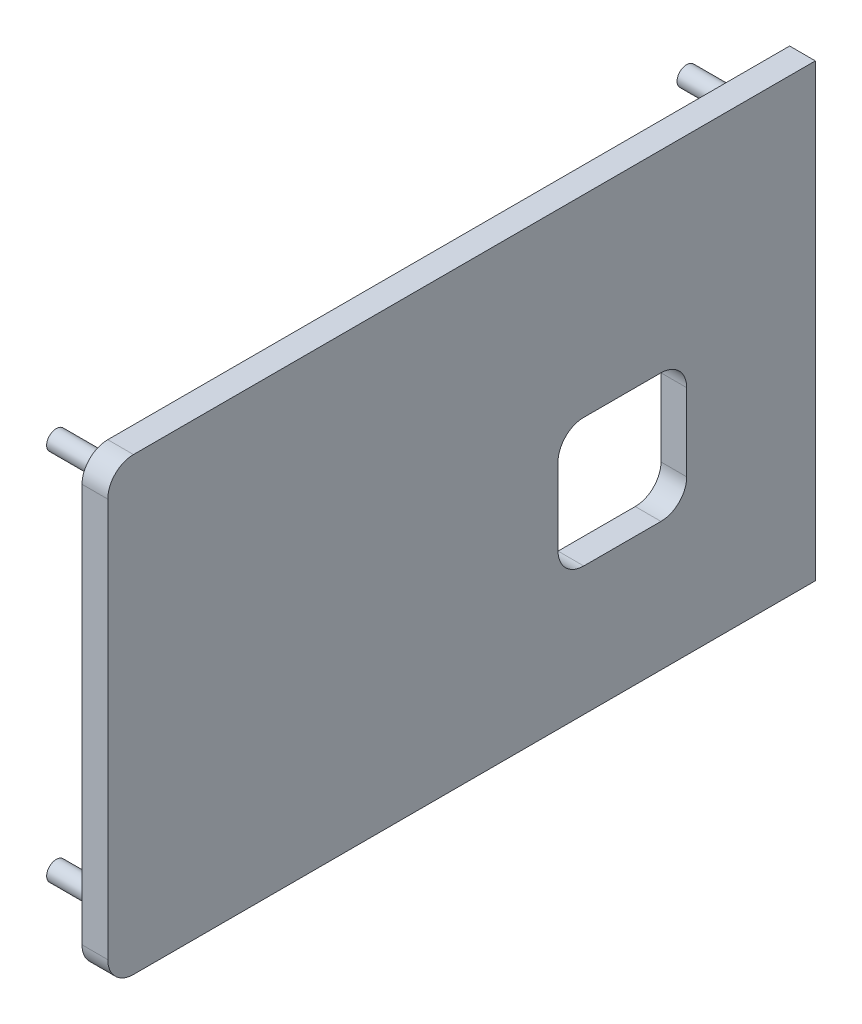
ISO-10303-21;
HEADER;
FILE_DESCRIPTION(('STEP AP214'),'2;1');
FILE_NAME('part.step','',(''),(''),'','','');
FILE_SCHEMA(('AUTOMOTIVE_DESIGN { 1 0 10303 214 1 1 1 1 }'));
ENDSEC;
DATA;
#1=APPLICATION_CONTEXT('core data for automotive mechanical design processes');
#2=APPLICATION_PROTOCOL_DEFINITION('international standard','automotive_design',2000,#1);
#3=PRODUCT_CONTEXT('',#1,'mechanical');
#4=PRODUCT('Part','Part','',(#3));
#5=PRODUCT_RELATED_PRODUCT_CATEGORY('part','',(#4));
#6=PRODUCT_DEFINITION_FORMATION('','',#4);
#7=PRODUCT_DEFINITION_CONTEXT('part definition',#1,'design');
#8=PRODUCT_DEFINITION('design','',#6,#7);
#9=PRODUCT_DEFINITION_SHAPE('','',#8);
#10=(LENGTH_UNIT() NAMED_UNIT(*) SI_UNIT(.MILLI.,.METRE.));
#11=(NAMED_UNIT(*) PLANE_ANGLE_UNIT() SI_UNIT($,.RADIAN.));
#12=(NAMED_UNIT(*) SI_UNIT($,.STERADIAN.) SOLID_ANGLE_UNIT());
#13=UNCERTAINTY_MEASURE_WITH_UNIT(LENGTH_MEASURE(1.E-05),#10,'distance_accuracy_value','');
#14=(GEOMETRIC_REPRESENTATION_CONTEXT(3) GLOBAL_UNCERTAINTY_ASSIGNED_CONTEXT((#13)) GLOBAL_UNIT_ASSIGNED_CONTEXT((#10,
#11,#12)) REPRESENTATION_CONTEXT('',''));
#15=CARTESIAN_POINT('',(0.,0.,0.));
#16=DIRECTION('',(0.,0.,1.));
#17=DIRECTION('',(1.,0.,0.));
#18=AXIS2_PLACEMENT_3D('',#15,#16,#17);
#19=CARTESIAN_POINT('',(5.08,48.6803223713978,-69.9642904621611));
#20=DIRECTION('',(0.,0.,1.));
#21=DIRECTION('',(1.,0.,0.));
#22=AXIS2_PLACEMENT_3D('',#19,#20,#21);
#23=PLANE('',#22);
#24=DIRECTION('',(0.,1.,0.));
#25=VECTOR('',#24,1.);
#26=CARTESIAN_POINT('',(0.,48.6803223713978,-69.9642904621611));
#27=LINE('',#26,#25);
#28=CARTESIAN_POINT('',(0.,-40.2196776286022,-69.9642904621611));
#29=VERTEX_POINT('',#28);
#30=CARTESIAN_POINT('',(0.,48.6803223713978,-69.9642904621611));
#31=VERTEX_POINT('',#30);
#32=EDGE_CURVE('E169',#29,#31,#27,.T.);
#33=ORIENTED_EDGE('',*,*,#32,.T.);
#34=DIRECTION('',(-1.,0.,0.));
#35=VECTOR('',#34,1.);
#36=CARTESIAN_POINT('',(5.08,48.6803223713978,-69.9642904621611));
#37=LINE('',#36,#35);
#38=CARTESIAN_POINT('',(5.08,48.6803223713978,-69.9642904621611));
#39=VERTEX_POINT('',#38);
#40=EDGE_CURVE('E148',#39,#31,#37,.T.);
#41=ORIENTED_EDGE('',*,*,#40,.F.);
#42=DIRECTION('',(0.,1.,0.));
#43=VECTOR('',#42,1.);
#44=CARTESIAN_POINT('',(5.08,48.6803223713978,-69.9642904621611));
#45=LINE('',#44,#43);
#46=CARTESIAN_POINT('',(5.08,-40.2196776286022,-69.9642904621611));
#47=VERTEX_POINT('',#46);
#48=EDGE_CURVE('E156',#47,#39,#45,.T.);
#49=ORIENTED_EDGE('',*,*,#48,.F.);
#50=DIRECTION('',(-1.,0.,0.));
#51=VECTOR('',#50,1.);
#52=CARTESIAN_POINT('',(5.08,-40.2196776286022,-69.9642904621611));
#53=LINE('',#52,#51);
#54=EDGE_CURVE('E172',#47,#29,#53,.T.);
#55=ORIENTED_EDGE('',*,*,#54,.T.);
#56=EDGE_LOOP('',(#33,#41,#49,#55));
#57=FACE_BOUND('',#56,.T.);
#58=ADVANCED_FACE('F41',(#57),#23,.F.);
#59=CARTESIAN_POINT('',(5.08,48.6803223713978,69.7357095378389));
#60=DIRECTION('',(0.,-1.,0.));
#61=DIRECTION('',(0.,0.,-1.));
#62=AXIS2_PLACEMENT_3D('',#59,#60,#61);
#63=PLANE('',#62);
#64=DIRECTION('',(0.,0.,1.));
#65=VECTOR('',#64,1.);
#66=CARTESIAN_POINT('',(0.,48.6803223713978,69.7357095378389));
#67=LINE('',#66,#65);
#68=CARTESIAN_POINT('',(0.,48.6803223713978,64.6557095378389));
#69=VERTEX_POINT('',#68);
#70=EDGE_CURVE('E327',#31,#69,#67,.T.);
#71=ORIENTED_EDGE('',*,*,#70,.T.);
#72=DIRECTION('',(-1.,0.,0.));
#73=VECTOR('',#72,1.);
#74=CARTESIAN_POINT('',(5.08,48.6803223713978,64.6557095378389));
#75=LINE('',#74,#73);
#76=CARTESIAN_POINT('',(5.08,48.6803223713978,64.6557095378389));
#77=VERTEX_POINT('',#76);
#78=EDGE_CURVE('E151',#69,#77,#75,.F.);
#79=ORIENTED_EDGE('',*,*,#78,.T.);
#80=DIRECTION('',(0.,0.,1.));
#81=VECTOR('',#80,1.);
#82=CARTESIAN_POINT('',(5.08,48.6803223713978,69.7357095378389));
#83=LINE('',#82,#81);
#84=EDGE_CURVE('E143',#39,#77,#83,.T.);
#85=ORIENTED_EDGE('',*,*,#84,.F.);
#86=ORIENTED_EDGE('',*,*,#40,.T.);
#87=EDGE_LOOP('',(#71,#79,#85,#86));
#88=FACE_BOUND('',#87,.T.);
#89=ADVANCED_FACE('F146',(#88),#63,.F.);
#90=CARTESIAN_POINT('',(5.08,48.6803223713978,69.7357095378389));
#91=DIRECTION('',(0.,0.,-1.));
#92=DIRECTION('',(-1.,0.,0.));
#93=AXIS2_PLACEMENT_3D('',#90,#91,#92);
#94=PLANE('',#93);
#95=DIRECTION('',(0.,-1.,0.));
#96=VECTOR('',#95,1.);
#97=CARTESIAN_POINT('',(5.08,48.6803223713978,69.7357095378389));
#98=LINE('',#97,#96);
#99=CARTESIAN_POINT('',(5.08,43.6003223713978,69.7357095378389));
#100=VERTEX_POINT('',#99);
#101=CARTESIAN_POINT('',(5.08,-35.1396776286022,69.7357095378389));
#102=VERTEX_POINT('',#101);
#103=EDGE_CURVE('E155',#100,#102,#98,.T.);
#104=ORIENTED_EDGE('',*,*,#103,.F.);
#105=DIRECTION('',(-1.,0.,0.));
#106=VECTOR('',#105,1.);
#107=CARTESIAN_POINT('',(5.08,43.6003223713978,69.7357095378389));
#108=LINE('',#107,#106);
#109=CARTESIAN_POINT('',(0.,43.6003223713978,69.7357095378389));
#110=VERTEX_POINT('',#109);
#111=EDGE_CURVE('E196',#100,#110,#108,.T.);
#112=ORIENTED_EDGE('',*,*,#111,.T.);
#113=DIRECTION('',(0.,-1.,0.));
#114=VECTOR('',#113,1.);
#115=CARTESIAN_POINT('',(0.,48.6803223713978,69.7357095378389));
#116=LINE('',#115,#114);
#117=CARTESIAN_POINT('',(0.,-35.1396776286022,69.7357095378389));
#118=VERTEX_POINT('',#117);
#119=EDGE_CURVE('E330',#110,#118,#116,.T.);
#120=ORIENTED_EDGE('',*,*,#119,.T.);
#121=DIRECTION('',(-1.,0.,0.));
#122=VECTOR('',#121,1.);
#123=CARTESIAN_POINT('',(5.08,-35.1396776286022,69.7357095378389));
#124=LINE('',#123,#122);
#125=EDGE_CURVE('E193',#118,#102,#124,.F.);
#126=ORIENTED_EDGE('',*,*,#125,.T.);
#127=EDGE_LOOP('',(#104,#112,#120,#126));
#128=FACE_BOUND('',#127,.T.);
#129=ADVANCED_FACE('F347',(#128),#94,.F.);
#130=CARTESIAN_POINT('',(5.08,-40.2196776286022,69.7357095378389));
#131=DIRECTION('',(0.,1.,0.));
#132=DIRECTION('',(0.,0.,1.));
#133=AXIS2_PLACEMENT_3D('',#130,#131,#132);
#134=PLANE('',#133);
#135=DIRECTION('',(0.,0.,-1.));
#136=VECTOR('',#135,1.);
#137=CARTESIAN_POINT('',(5.08,-40.2196776286022,69.7357095378389));
#138=LINE('',#137,#136);
#139=CARTESIAN_POINT('',(5.08,-40.2196776286022,64.6557095378389));
#140=VERTEX_POINT('',#139);
#141=EDGE_CURVE('E161',#140,#47,#138,.T.);
#142=ORIENTED_EDGE('',*,*,#141,.F.);
#143=DIRECTION('',(-1.,0.,0.));
#144=VECTOR('',#143,1.);
#145=CARTESIAN_POINT('',(5.08,-40.2196776286022,64.6557095378389));
#146=LINE('',#145,#144);
#147=CARTESIAN_POINT('',(0.,-40.2196776286022,64.6557095378389));
#148=VERTEX_POINT('',#147);
#149=EDGE_CURVE('E214',#140,#148,#146,.T.);
#150=ORIENTED_EDGE('',*,*,#149,.T.);
#151=DIRECTION('',(0.,0.,-1.));
#152=VECTOR('',#151,1.);
#153=CARTESIAN_POINT('',(0.,-40.2196776286022,69.7357095378389));
#154=LINE('',#153,#152);
#155=EDGE_CURVE('E166',#148,#29,#154,.T.);
#156=ORIENTED_EDGE('',*,*,#155,.T.);
#157=ORIENTED_EDGE('',*,*,#54,.F.);
#158=EDGE_LOOP('',(#142,#150,#156,#157));
#159=FACE_BOUND('',#158,.T.);
#160=ADVANCED_FACE('F336',(#159),#134,.F.);
#161=CARTESIAN_POINT('',(5.08,0.,0.));
#162=DIRECTION('',(1.,0.,0.));
#163=DIRECTION('',(0.,0.,-1.));
#164=AXIS2_PLACEMENT_3D('',#161,#162,#163);
#165=PLANE('',#164);
#166=DIRECTION('',(0.,1.,0.));
#167=VECTOR('',#166,1.);
#168=CARTESIAN_POINT('',(5.08,-14.8196776286022,-44.5642904621611));
#169=LINE('',#168,#167);
#170=CARTESIAN_POINT('',(5.08,-9.73967762860219,-44.5642904621611));
#171=VERTEX_POINT('',#170);
#172=CARTESIAN_POINT('',(5.08,5.50032237139781,-44.5642904621611));
#173=VERTEX_POINT('',#172);
#174=EDGE_CURVE('E278',#171,#173,#169,.T.);
#175=ORIENTED_EDGE('',*,*,#174,.F.);
#176=CARTESIAN_POINT('',(5.08,-9.73967762860219,-39.4842904621611));
#177=DIRECTION('',(1.,0.,0.));
#178=DIRECTION('',(0.,0.,-1.));
#179=AXIS2_PLACEMENT_3D('',#176,#177,#178);
#180=CIRCLE('',#179,5.08);
#181=CARTESIAN_POINT('',(5.08,-14.8196776286022,-39.4842904621611));
#182=VERTEX_POINT('',#181);
#183=EDGE_CURVE('E251',#171,#182,#180,.F.);
#184=ORIENTED_EDGE('',*,*,#183,.T.);
#185=DIRECTION('',(0.,0.,-1.));
#186=VECTOR('',#185,1.);
#187=CARTESIAN_POINT('',(5.08,-14.8196776286022,-44.5642904621611));
#188=LINE('',#187,#186);
#189=CARTESIAN_POINT('',(5.08,-14.8196776286022,-24.2442904621611));
#190=VERTEX_POINT('',#189);
#191=EDGE_CURVE('E301',#190,#182,#188,.T.);
#192=ORIENTED_EDGE('',*,*,#191,.F.);
#193=CARTESIAN_POINT('',(5.08,-9.73967762860219,-24.2442904621611));
#194=DIRECTION('',(1.,0.,0.));
#195=DIRECTION('',(0.,0.,-1.));
#196=AXIS2_PLACEMENT_3D('',#193,#194,#195);
#197=CIRCLE('',#196,5.08);
#198=CARTESIAN_POINT('',(5.08,-9.73967762860219,-19.1642904621611));
#199=VERTEX_POINT('',#198);
#200=EDGE_CURVE('E257',#190,#199,#197,.F.);
#201=ORIENTED_EDGE('',*,*,#200,.T.);
#202=DIRECTION('',(0.,-1.,0.));
#203=VECTOR('',#202,1.);
#204=CARTESIAN_POINT('',(5.08,-14.8196776286022,-19.1642904621611));
#205=LINE('',#204,#203);
#206=CARTESIAN_POINT('',(5.08,5.50032237139781,-19.1642904621611));
#207=VERTEX_POINT('',#206);
#208=EDGE_CURVE('E269',#207,#199,#205,.T.);
#209=ORIENTED_EDGE('',*,*,#208,.F.);
#210=CARTESIAN_POINT('',(5.08,5.50032237139781,-24.2442904621611));
#211=DIRECTION('',(1.,0.,0.));
#212=DIRECTION('',(0.,0.,-1.));
#213=AXIS2_PLACEMENT_3D('',#210,#211,#212);
#214=CIRCLE('',#213,5.08);
#215=CARTESIAN_POINT('',(5.08,10.5803223713978,-24.2442904621611));
#216=VERTEX_POINT('',#215);
#217=EDGE_CURVE('E50',#207,#216,#214,.F.);
#218=ORIENTED_EDGE('',*,*,#217,.T.);
#219=DIRECTION('',(0.,0.,1.));
#220=VECTOR('',#219,1.);
#221=CARTESIAN_POINT('',(5.08,10.5803223713978,-44.5642904621611));
#222=LINE('',#221,#220);
#223=CARTESIAN_POINT('',(5.08,10.5803223713978,-39.4842904621611));
#224=VERTEX_POINT('',#223);
#225=EDGE_CURVE('E268',#224,#216,#222,.T.);
#226=ORIENTED_EDGE('',*,*,#225,.F.);
#227=CARTESIAN_POINT('',(5.08,5.50032237139781,-39.4842904621611));
#228=DIRECTION('',(1.,0.,0.));
#229=DIRECTION('',(0.,0.,-1.));
#230=AXIS2_PLACEMENT_3D('',#227,#228,#229);
#231=CIRCLE('',#230,5.08);
#232=EDGE_CURVE('E245',#224,#173,#231,.F.);
#233=ORIENTED_EDGE('',*,*,#232,.T.);
#234=EDGE_LOOP('',(#175,#184,#192,#201,#209,#218,#226,#233));
#235=FACE_BOUND('',#234,.T.);
#236=ORIENTED_EDGE('',*,*,#84,.T.);
#237=CARTESIAN_POINT('',(5.08,43.6003223713978,64.6557095378389));
#238=DIRECTION('',(1.,0.,0.));
#239=DIRECTION('',(0.,0.,-1.));
#240=AXIS2_PLACEMENT_3D('',#237,#238,#239);
#241=CIRCLE('',#240,5.08);
#242=EDGE_CURVE('E211',#77,#100,#241,.T.);
#243=ORIENTED_EDGE('',*,*,#242,.T.);
#244=ORIENTED_EDGE('',*,*,#103,.T.);
#245=CARTESIAN_POINT('',(5.08,-35.1396776286022,64.6557095378389));
#246=DIRECTION('',(1.,0.,0.));
#247=DIRECTION('',(0.,0.,-1.));
#248=AXIS2_PLACEMENT_3D('',#245,#246,#247);
#249=CIRCLE('',#248,5.08);
#250=EDGE_CURVE('E208',#102,#140,#249,.T.);
#251=ORIENTED_EDGE('',*,*,#250,.T.);
#252=ORIENTED_EDGE('',*,*,#141,.T.);
#253=ORIENTED_EDGE('',*,*,#48,.T.);
#254=EDGE_LOOP('',(#236,#243,#244,#251,#252,#253));
#255=FACE_BOUND('',#254,.T.);
#256=ADVANCED_FACE('F159',(#235,#255),#165,.T.);
#257=CARTESIAN_POINT('',(0.,0.,0.));
#258=DIRECTION('',(1.,0.,0.));
#259=DIRECTION('',(0.,0.,-1.));
#260=AXIS2_PLACEMENT_3D('',#257,#258,#259);
#261=PLANE('',#260);
#262=DIRECTION('',(0.,-1.,0.));
#263=VECTOR('',#262,1.);
#264=CARTESIAN_POINT('',(0.,-14.8196776286022,-19.1642904621611));
#265=LINE('',#264,#263);
#266=CARTESIAN_POINT('',(0.,5.50032237139781,-19.1642904621611));
#267=VERTEX_POINT('',#266);
#268=CARTESIAN_POINT('',(0.,-9.73967762860219,-19.1642904621611));
#269=VERTEX_POINT('',#268);
#270=EDGE_CURVE('E281',#267,#269,#265,.T.);
#271=ORIENTED_EDGE('',*,*,#270,.T.);
#272=CARTESIAN_POINT('',(0.,-9.73967762860219,-24.2442904621611));
#273=DIRECTION('',(1.,0.,0.));
#274=DIRECTION('',(0.,0.,-1.));
#275=AXIS2_PLACEMENT_3D('',#272,#273,#274);
#276=CIRCLE('',#275,5.08);
#277=CARTESIAN_POINT('',(0.,-14.8196776286022,-24.2442904621611));
#278=VERTEX_POINT('',#277);
#279=EDGE_CURVE('E260',#269,#278,#276,.T.);
#280=ORIENTED_EDGE('',*,*,#279,.T.);
#281=DIRECTION('',(0.,0.,-1.));
#282=VECTOR('',#281,1.);
#283=CARTESIAN_POINT('',(0.,-14.8196776286022,-44.5642904621611));
#284=LINE('',#283,#282);
#285=CARTESIAN_POINT('',(0.,-14.8196776286022,-39.4842904621611));
#286=VERTEX_POINT('',#285);
#287=EDGE_CURVE('E284',#278,#286,#284,.T.);
#288=ORIENTED_EDGE('',*,*,#287,.T.);
#289=CARTESIAN_POINT('',(0.,-9.73967762860219,-39.4842904621611));
#290=DIRECTION('',(1.,0.,0.));
#291=DIRECTION('',(0.,0.,-1.));
#292=AXIS2_PLACEMENT_3D('',#289,#290,#291);
#293=CIRCLE('',#292,5.08);
#294=CARTESIAN_POINT('',(0.,-9.73967762860219,-44.5642904621611));
#295=VERTEX_POINT('',#294);
#296=EDGE_CURVE('E254',#286,#295,#293,.T.);
#297=ORIENTED_EDGE('',*,*,#296,.T.);
#298=DIRECTION('',(0.,1.,0.));
#299=VECTOR('',#298,1.);
#300=CARTESIAN_POINT('',(0.,-14.8196776286022,-44.5642904621611));
#301=LINE('',#300,#299);
#302=CARTESIAN_POINT('',(0.,5.50032237139781,-44.5642904621611));
#303=VERTEX_POINT('',#302);
#304=EDGE_CURVE('E292',#295,#303,#301,.T.);
#305=ORIENTED_EDGE('',*,*,#304,.T.);
#306=CARTESIAN_POINT('',(0.,5.50032237139781,-39.4842904621611));
#307=DIRECTION('',(1.,0.,0.));
#308=DIRECTION('',(0.,0.,-1.));
#309=AXIS2_PLACEMENT_3D('',#306,#307,#308);
#310=CIRCLE('',#309,5.08);
#311=CARTESIAN_POINT('',(0.,10.5803223713978,-39.4842904621611));
#312=VERTEX_POINT('',#311);
#313=EDGE_CURVE('E248',#303,#312,#310,.T.);
#314=ORIENTED_EDGE('',*,*,#313,.T.);
#315=DIRECTION('',(0.,0.,1.));
#316=VECTOR('',#315,1.);
#317=CARTESIAN_POINT('',(0.,10.5803223713978,-44.5642904621611));
#318=LINE('',#317,#316);
#319=CARTESIAN_POINT('',(0.,10.5803223713978,-24.2442904621611));
#320=VERTEX_POINT('',#319);
#321=EDGE_CURVE('E285',#312,#320,#318,.T.);
#322=ORIENTED_EDGE('',*,*,#321,.T.);
#323=CARTESIAN_POINT('',(0.,5.50032237139781,-24.2442904621611));
#324=DIRECTION('',(1.,0.,0.));
#325=DIRECTION('',(0.,0.,-1.));
#326=AXIS2_PLACEMENT_3D('',#323,#324,#325);
#327=CIRCLE('',#326,5.08);
#328=EDGE_CURVE('E11',#320,#267,#327,.T.);
#329=ORIENTED_EDGE('',*,*,#328,.T.);
#330=EDGE_LOOP('',(#271,#280,#288,#297,#305,#314,#322,#329));
#331=FACE_BOUND('',#330,.T.);
#332=CARTESIAN_POINT('',(0.,-32.5996776286022,62.1157095378389));
#333=DIRECTION('',(1.,0.,0.));
#334=DIRECTION('',(0.,0.,-1.));
#335=AXIS2_PLACEMENT_3D('',#332,#333,#334);
#336=CIRCLE('',#335,1.90500000000001);
#337=CARTESIAN_POINT('',(0.,-32.5996776286022,60.2107095378389));
#338=VERTEX_POINT('',#337);
#339=EDGE_CURVE('E189',#338,#338,#336,.F.);
#340=ORIENTED_EDGE('',*,*,#339,.F.);
#341=EDGE_LOOP('',(#340));
#342=FACE_BOUND('',#341,.T.);
#343=CARTESIAN_POINT('',(0.,41.0603223713978,62.1157095378389));
#344=DIRECTION('',(1.,0.,0.));
#345=DIRECTION('',(0.,0.,-1.));
#346=AXIS2_PLACEMENT_3D('',#343,#344,#345);
#347=CIRCLE('',#346,1.90500000000001);
#348=CARTESIAN_POINT('',(0.,41.0603223713978,60.2107095378389));
#349=VERTEX_POINT('',#348);
#350=EDGE_CURVE('E185',#349,#349,#347,.F.);
#351=ORIENTED_EDGE('',*,*,#350,.F.);
#352=EDGE_LOOP('',(#351));
#353=FACE_BOUND('',#352,.T.);
#354=CARTESIAN_POINT('',(0.,-32.5996776286022,-62.3442904621611));
#355=DIRECTION('',(1.,0.,0.));
#356=DIRECTION('',(0.,0.,-1.));
#357=AXIS2_PLACEMENT_3D('',#354,#355,#356);
#358=CIRCLE('',#357,1.905);
#359=CARTESIAN_POINT('',(0.,-32.5996776286022,-64.2492904621611));
#360=VERTEX_POINT('',#359);
#361=EDGE_CURVE('E177',#360,#360,#358,.F.);
#362=ORIENTED_EDGE('',*,*,#361,.F.);
#363=EDGE_LOOP('',(#362));
#364=FACE_BOUND('',#363,.T.);
#365=CARTESIAN_POINT('',(0.,41.0603223713978,-62.3442904621611));
#366=DIRECTION('',(1.,0.,0.));
#367=DIRECTION('',(0.,0.,-1.));
#368=AXIS2_PLACEMENT_3D('',#365,#366,#367);
#369=CIRCLE('',#368,1.905);
#370=CARTESIAN_POINT('',(0.,41.0603223713978,-64.2492904621611));
#371=VERTEX_POINT('',#370);
#372=EDGE_CURVE('E171',#371,#371,#369,.F.);
#373=ORIENTED_EDGE('',*,*,#372,.F.);
#374=EDGE_LOOP('',(#373));
#375=FACE_BOUND('',#374,.T.);
#376=ORIENTED_EDGE('',*,*,#119,.F.);
#377=CARTESIAN_POINT('',(0.,43.6003223713978,64.6557095378389));
#378=DIRECTION('',(1.,0.,0.));
#379=DIRECTION('',(0.,0.,-1.));
#380=AXIS2_PLACEMENT_3D('',#377,#378,#379);
#381=CIRCLE('',#380,5.08);
#382=EDGE_CURVE('E203',#110,#69,#381,.F.);
#383=ORIENTED_EDGE('',*,*,#382,.T.);
#384=ORIENTED_EDGE('',*,*,#70,.F.);
#385=ORIENTED_EDGE('',*,*,#32,.F.);
#386=ORIENTED_EDGE('',*,*,#155,.F.);
#387=CARTESIAN_POINT('',(0.,-35.1396776286022,64.6557095378389));
#388=DIRECTION('',(1.,0.,0.));
#389=DIRECTION('',(0.,0.,-1.));
#390=AXIS2_PLACEMENT_3D('',#387,#388,#389);
#391=CIRCLE('',#390,5.08);
#392=EDGE_CURVE('E200',#148,#118,#391,.F.);
#393=ORIENTED_EDGE('',*,*,#392,.T.);
#394=EDGE_LOOP('',(#376,#383,#384,#385,#386,#393));
#395=FACE_BOUND('',#394,.T.);
#396=ADVANCED_FACE('F340',(#331,#342,#353,#364,#375,#395),#261,.F.);
#397=CARTESIAN_POINT('',(-12.7,41.0603223713978,-62.3442904621611));
#398=DIRECTION('',(1.,0.,0.));
#399=DIRECTION('',(0.,0.,-1.));
#400=AXIS2_PLACEMENT_3D('',#397,#398,#399);
#401=CYLINDRICAL_SURFACE('',#400,1.905);
#402=CARTESIAN_POINT('',(-12.7,41.0603223713978,-62.3442904621611));
#403=DIRECTION('',(-1.,0.,0.));
#404=DIRECTION('',(0.,0.,1.));
#405=AXIS2_PLACEMENT_3D('',#402,#403,#404);
#406=CIRCLE('',#405,1.905);
#407=CARTESIAN_POINT('',(-12.7,41.0603223713978,-60.4392904621611));
#408=VERTEX_POINT('',#407);
#409=EDGE_CURVE('E316',#408,#408,#406,.T.);
#410=ORIENTED_EDGE('',*,*,#409,.F.);
#411=EDGE_LOOP('',(#410));
#412=FACE_BOUND('',#411,.T.);
#413=ORIENTED_EDGE('',*,*,#372,.T.);
#414=EDGE_LOOP('',(#413));
#415=FACE_BOUND('',#414,.T.);
#416=ADVANCED_FACE('F377',(#412,#415),#401,.T.);
#417=CARTESIAN_POINT('',(-12.7,0.,0.));
#418=DIRECTION('',(-1.,0.,0.));
#419=DIRECTION('',(0.,0.,1.));
#420=AXIS2_PLACEMENT_3D('',#417,#418,#419);
#421=PLANE('',#420);
#422=ORIENTED_EDGE('',*,*,#409,.T.);
#423=EDGE_LOOP('',(#422));
#424=FACE_BOUND('',#423,.T.);
#425=ADVANCED_FACE('F382',(#424),#421,.T.);
#426=CARTESIAN_POINT('',(-12.7,-32.5996776286022,-62.3442904621611));
#427=DIRECTION('',(1.,0.,0.));
#428=DIRECTION('',(0.,0.,-1.));
#429=AXIS2_PLACEMENT_3D('',#426,#427,#428);
#430=CYLINDRICAL_SURFACE('',#429,1.905);
#431=CARTESIAN_POINT('',(-12.7,-32.5996776286022,-62.3442904621611));
#432=DIRECTION('',(-1.,0.,0.));
#433=DIRECTION('',(0.,0.,1.));
#434=AXIS2_PLACEMENT_3D('',#431,#432,#433);
#435=CIRCLE('',#434,1.905);
#436=CARTESIAN_POINT('',(-12.7,-32.5996776286022,-60.4392904621611));
#437=VERTEX_POINT('',#436);
#438=EDGE_CURVE('E312',#437,#437,#435,.T.);
#439=ORIENTED_EDGE('',*,*,#438,.F.);
#440=EDGE_LOOP('',(#439));
#441=FACE_BOUND('',#440,.T.);
#442=ORIENTED_EDGE('',*,*,#361,.T.);
#443=EDGE_LOOP('',(#442));
#444=FACE_BOUND('',#443,.T.);
#445=ADVANCED_FACE('F386',(#441,#444),#430,.T.);
#446=CARTESIAN_POINT('',(-12.7,0.,0.));
#447=DIRECTION('',(-1.,0.,0.));
#448=DIRECTION('',(0.,0.,1.));
#449=AXIS2_PLACEMENT_3D('',#446,#447,#448);
#450=PLANE('',#449);
#451=ORIENTED_EDGE('',*,*,#438,.T.);
#452=EDGE_LOOP('',(#451));
#453=FACE_BOUND('',#452,.T.);
#454=ADVANCED_FACE('F390',(#453),#450,.T.);
#455=CARTESIAN_POINT('',(-12.7,41.0603223713978,62.1157095378389));
#456=DIRECTION('',(1.,0.,0.));
#457=DIRECTION('',(0.,0.,-1.));
#458=AXIS2_PLACEMENT_3D('',#455,#456,#457);
#459=CYLINDRICAL_SURFACE('',#458,1.90500000000001);
#460=CARTESIAN_POINT('',(-12.7,41.0603223713978,62.1157095378389));
#461=DIRECTION('',(-1.,0.,0.));
#462=DIRECTION('',(0.,0.,1.));
#463=AXIS2_PLACEMENT_3D('',#460,#461,#462);
#464=CIRCLE('',#463,1.90500000000001);
#465=CARTESIAN_POINT('',(-12.7,41.0603223713978,64.0207095378389));
#466=VERTEX_POINT('',#465);
#467=EDGE_CURVE('E308',#466,#466,#464,.T.);
#468=ORIENTED_EDGE('',*,*,#467,.F.);
#469=EDGE_LOOP('',(#468));
#470=FACE_BOUND('',#469,.T.);
#471=ORIENTED_EDGE('',*,*,#350,.T.);
#472=EDGE_LOOP('',(#471));
#473=FACE_BOUND('',#472,.T.);
#474=ADVANCED_FACE('F394',(#470,#473),#459,.T.);
#475=CARTESIAN_POINT('',(-12.7,0.,0.));
#476=DIRECTION('',(-1.,0.,0.));
#477=DIRECTION('',(0.,0.,1.));
#478=AXIS2_PLACEMENT_3D('',#475,#476,#477);
#479=PLANE('',#478);
#480=ORIENTED_EDGE('',*,*,#467,.T.);
#481=EDGE_LOOP('',(#480));
#482=FACE_BOUND('',#481,.T.);
#483=ADVANCED_FACE('F398',(#482),#479,.T.);
#484=CARTESIAN_POINT('',(-12.7,-32.5996776286022,62.1157095378389));
#485=DIRECTION('',(1.,0.,0.));
#486=DIRECTION('',(0.,0.,-1.));
#487=AXIS2_PLACEMENT_3D('',#484,#485,#486);
#488=CYLINDRICAL_SURFACE('',#487,1.90500000000001);
#489=CARTESIAN_POINT('',(-12.7,-32.5996776286022,62.1157095378389));
#490=DIRECTION('',(-1.,0.,0.));
#491=DIRECTION('',(0.,0.,1.));
#492=AXIS2_PLACEMENT_3D('',#489,#490,#491);
#493=CIRCLE('',#492,1.90500000000001);
#494=CARTESIAN_POINT('',(-12.7,-32.5996776286022,64.0207095378389));
#495=VERTEX_POINT('',#494);
#496=EDGE_CURVE('E290',#495,#495,#493,.T.);
#497=ORIENTED_EDGE('',*,*,#496,.F.);
#498=EDGE_LOOP('',(#497));
#499=FACE_BOUND('',#498,.T.);
#500=ORIENTED_EDGE('',*,*,#339,.T.);
#501=EDGE_LOOP('',(#500));
#502=FACE_BOUND('',#501,.T.);
#503=ADVANCED_FACE('F402',(#499,#502),#488,.T.);
#504=CARTESIAN_POINT('',(-12.7,0.,0.));
#505=DIRECTION('',(-1.,0.,0.));
#506=DIRECTION('',(0.,0.,1.));
#507=AXIS2_PLACEMENT_3D('',#504,#505,#506);
#508=PLANE('',#507);
#509=ORIENTED_EDGE('',*,*,#496,.T.);
#510=EDGE_LOOP('',(#509));
#511=FACE_BOUND('',#510,.T.);
#512=ADVANCED_FACE('F361',(#511),#508,.T.);
#513=CARTESIAN_POINT('',(5.08,43.6003223713978,64.6557095378389));
#514=DIRECTION('',(-1.,0.,0.));
#515=DIRECTION('',(0.,0.,1.));
#516=AXIS2_PLACEMENT_3D('',#513,#514,#515);
#517=CYLINDRICAL_SURFACE('',#516,5.08);
#518=ORIENTED_EDGE('',*,*,#242,.F.);
#519=ORIENTED_EDGE('',*,*,#78,.F.);
#520=ORIENTED_EDGE('',*,*,#382,.F.);
#521=ORIENTED_EDGE('',*,*,#111,.F.);
#522=EDGE_LOOP('',(#518,#519,#520,#521));
#523=FACE_BOUND('',#522,.T.);
#524=ADVANCED_FACE('F342',(#523),#517,.T.);
#525=CARTESIAN_POINT('',(5.08,-35.1396776286022,64.6557095378389));
#526=DIRECTION('',(-1.,0.,0.));
#527=DIRECTION('',(0.,0.,1.));
#528=AXIS2_PLACEMENT_3D('',#525,#526,#527);
#529=CYLINDRICAL_SURFACE('',#528,5.08);
#530=ORIENTED_EDGE('',*,*,#250,.F.);
#531=ORIENTED_EDGE('',*,*,#125,.F.);
#532=ORIENTED_EDGE('',*,*,#392,.F.);
#533=ORIENTED_EDGE('',*,*,#149,.F.);
#534=EDGE_LOOP('',(#530,#531,#532,#533));
#535=FACE_BOUND('',#534,.T.);
#536=ADVANCED_FACE('F350',(#535),#529,.T.);
#537=CARTESIAN_POINT('',(0.,-14.8196776286022,-44.5642904621611));
#538=DIRECTION('',(0.,0.,-1.));
#539=DIRECTION('',(-1.,0.,0.));
#540=AXIS2_PLACEMENT_3D('',#537,#538,#539);
#541=PLANE('',#540);
#542=ORIENTED_EDGE('',*,*,#174,.T.);
#543=DIRECTION('',(1.,0.,0.));
#544=VECTOR('',#543,1.);
#545=CARTESIAN_POINT('',(0.,5.50032237139781,-44.5642904621611));
#546=LINE('',#545,#544);
#547=EDGE_CURVE('E229',#173,#303,#546,.F.);
#548=ORIENTED_EDGE('',*,*,#547,.T.);
#549=ORIENTED_EDGE('',*,*,#304,.F.);
#550=DIRECTION('',(1.,0.,0.));
#551=VECTOR('',#550,1.);
#552=CARTESIAN_POINT('',(5.08,-9.73967762860219,-44.5642904621611));
#553=LINE('',#552,#551);
#554=EDGE_CURVE('E225',#295,#171,#553,.T.);
#555=ORIENTED_EDGE('',*,*,#554,.T.);
#556=EDGE_LOOP('',(#542,#548,#549,#555));
#557=FACE_BOUND('',#556,.T.);
#558=ADVANCED_FACE('F352',(#557),#541,.F.);
#559=CARTESIAN_POINT('',(0.,-14.8196776286022,-44.5642904621611));
#560=DIRECTION('',(0.,-1.,0.));
#561=DIRECTION('',(0.,0.,-1.));
#562=AXIS2_PLACEMENT_3D('',#559,#560,#561);
#563=PLANE('',#562);
#564=ORIENTED_EDGE('',*,*,#191,.T.);
#565=DIRECTION('',(1.,0.,0.));
#566=VECTOR('',#565,1.);
#567=CARTESIAN_POINT('',(0.,-14.8196776286022,-39.4842904621611));
#568=LINE('',#567,#566);
#569=EDGE_CURVE('E236',#182,#286,#568,.F.);
#570=ORIENTED_EDGE('',*,*,#569,.T.);
#571=ORIENTED_EDGE('',*,*,#287,.F.);
#572=DIRECTION('',(1.,0.,0.));
#573=VECTOR('',#572,1.);
#574=CARTESIAN_POINT('',(5.08,-14.8196776286022,-24.2442904621611));
#575=LINE('',#574,#573);
#576=EDGE_CURVE('E232',#278,#190,#575,.T.);
#577=ORIENTED_EDGE('',*,*,#576,.T.);
#578=EDGE_LOOP('',(#564,#570,#571,#577));
#579=FACE_BOUND('',#578,.T.);
#580=ADVANCED_FACE('F358',(#579),#563,.F.);
#581=CARTESIAN_POINT('',(0.,-14.8196776286022,-19.1642904621611));
#582=DIRECTION('',(0.,0.,1.));
#583=DIRECTION('',(1.,0.,0.));
#584=AXIS2_PLACEMENT_3D('',#581,#582,#583);
#585=PLANE('',#584);
#586=ORIENTED_EDGE('',*,*,#208,.T.);
#587=DIRECTION('',(1.,0.,0.));
#588=VECTOR('',#587,1.);
#589=CARTESIAN_POINT('',(0.,-9.73967762860219,-19.1642904621611));
#590=LINE('',#589,#588);
#591=EDGE_CURVE('E57',#199,#269,#590,.F.);
#592=ORIENTED_EDGE('',*,*,#591,.T.);
#593=ORIENTED_EDGE('',*,*,#270,.F.);
#594=DIRECTION('',(1.,0.,0.));
#595=VECTOR('',#594,1.);
#596=CARTESIAN_POINT('',(5.08,5.50032237139781,-19.1642904621611));
#597=LINE('',#596,#595);
#598=EDGE_CURVE('E239',#267,#207,#597,.T.);
#599=ORIENTED_EDGE('',*,*,#598,.T.);
#600=EDGE_LOOP('',(#586,#592,#593,#599));
#601=FACE_BOUND('',#600,.T.);
#602=ADVANCED_FACE('F280',(#601),#585,.F.);
#603=CARTESIAN_POINT('',(0.,10.5803223713978,-44.5642904621611));
#604=DIRECTION('',(0.,1.,0.));
#605=DIRECTION('',(0.,0.,1.));
#606=AXIS2_PLACEMENT_3D('',#603,#604,#605);
#607=PLANE('',#606);
#608=ORIENTED_EDGE('',*,*,#321,.F.);
#609=DIRECTION('',(1.,0.,0.));
#610=VECTOR('',#609,1.);
#611=CARTESIAN_POINT('',(5.08,10.5803223713978,-39.4842904621611));
#612=LINE('',#611,#610);
#613=EDGE_CURVE('E221',#312,#224,#612,.T.);
#614=ORIENTED_EDGE('',*,*,#613,.T.);
#615=ORIENTED_EDGE('',*,*,#225,.T.);
#616=DIRECTION('',(1.,0.,0.));
#617=VECTOR('',#616,1.);
#618=CARTESIAN_POINT('',(0.,10.5803223713978,-24.2442904621611));
#619=LINE('',#618,#617);
#620=EDGE_CURVE('E218',#216,#320,#619,.F.);
#621=ORIENTED_EDGE('',*,*,#620,.T.);
#622=EDGE_LOOP('',(#608,#614,#615,#621));
#623=FACE_BOUND('',#622,.T.);
#624=ADVANCED_FACE('F275',(#623),#607,.F.);
#625=CARTESIAN_POINT('',(0.,5.50032237139781,-39.4842904621611));
#626=DIRECTION('',(-1.,0.,0.));
#627=DIRECTION('',(0.,0.,1.));
#628=AXIS2_PLACEMENT_3D('',#625,#626,#627);
#629=CYLINDRICAL_SURFACE('',#628,5.08);
#630=ORIENTED_EDGE('',*,*,#313,.F.);
#631=ORIENTED_EDGE('',*,*,#547,.F.);
#632=ORIENTED_EDGE('',*,*,#232,.F.);
#633=ORIENTED_EDGE('',*,*,#613,.F.);
#634=EDGE_LOOP('',(#630,#631,#632,#633));
#635=FACE_BOUND('',#634,.T.);
#636=ADVANCED_FACE('F412',(#635),#629,.F.);
#637=CARTESIAN_POINT('',(0.,-9.73967762860219,-39.4842904621611));
#638=DIRECTION('',(-1.,0.,0.));
#639=DIRECTION('',(0.,0.,1.));
#640=AXIS2_PLACEMENT_3D('',#637,#638,#639);
#641=CYLINDRICAL_SURFACE('',#640,5.08);
#642=ORIENTED_EDGE('',*,*,#296,.F.);
#643=ORIENTED_EDGE('',*,*,#569,.F.);
#644=ORIENTED_EDGE('',*,*,#183,.F.);
#645=ORIENTED_EDGE('',*,*,#554,.F.);
#646=EDGE_LOOP('',(#642,#643,#644,#645));
#647=FACE_BOUND('',#646,.T.);
#648=ADVANCED_FACE('F425',(#647),#641,.F.);
#649=CARTESIAN_POINT('',(0.,-9.73967762860219,-24.2442904621611));
#650=DIRECTION('',(-1.,0.,0.));
#651=DIRECTION('',(0.,0.,1.));
#652=AXIS2_PLACEMENT_3D('',#649,#650,#651);
#653=CYLINDRICAL_SURFACE('',#652,5.08);
#654=ORIENTED_EDGE('',*,*,#279,.F.);
#655=ORIENTED_EDGE('',*,*,#591,.F.);
#656=ORIENTED_EDGE('',*,*,#200,.F.);
#657=ORIENTED_EDGE('',*,*,#576,.F.);
#658=EDGE_LOOP('',(#654,#655,#656,#657));
#659=FACE_BOUND('',#658,.T.);
#660=ADVANCED_FACE('F438',(#659),#653,.F.);
#661=CARTESIAN_POINT('',(0.,5.50032237139781,-24.2442904621611));
#662=DIRECTION('',(-1.,0.,0.));
#663=DIRECTION('',(0.,0.,1.));
#664=AXIS2_PLACEMENT_3D('',#661,#662,#663);
#665=CYLINDRICAL_SURFACE('',#664,5.08);
#666=ORIENTED_EDGE('',*,*,#328,.F.);
#667=ORIENTED_EDGE('',*,*,#620,.F.);
#668=ORIENTED_EDGE('',*,*,#217,.F.);
#669=ORIENTED_EDGE('',*,*,#598,.F.);
#670=EDGE_LOOP('',(#666,#667,#668,#669));
#671=FACE_BOUND('',#670,.T.);
#672=ADVANCED_FACE('F43',(#671),#665,.F.);
#673=CLOSED_SHELL('',(#58,#89,#129,#160,#256,#396,#416,#425,#445,#454,#474,#483,#503,#512,#524,
#536,#558,#580,#602,#624,#636,#648,#660,#672));
#674=MANIFOLD_SOLID_BREP('B2',#673);
#675=ADVANCED_BREP_SHAPE_REPRESENTATION('',(#18,#674),#14);
#676=SHAPE_DEFINITION_REPRESENTATION(#9,#675);
ENDSEC;
END-ISO-10303-21;
